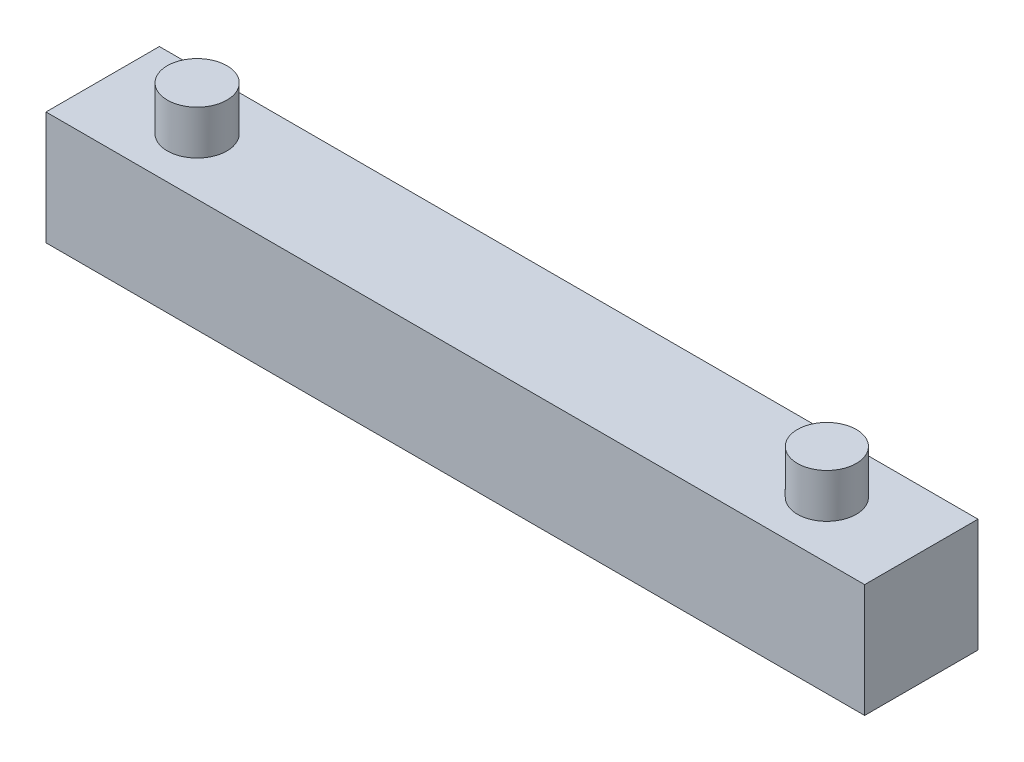
ISO-10303-21;
HEADER;
FILE_DESCRIPTION(('STEP AP214'),'2;1');
FILE_NAME('part.step','',(''),(''),'','','');
FILE_SCHEMA(('AUTOMOTIVE_DESIGN { 1 0 10303 214 1 1 1 1 }'));
ENDSEC;
DATA;
#1=APPLICATION_CONTEXT('core data for automotive mechanical design processes');
#2=APPLICATION_PROTOCOL_DEFINITION('international standard','automotive_design',2000,#1);
#3=PRODUCT_CONTEXT('',#1,'mechanical');
#4=PRODUCT('Part','Part','',(#3));
#5=PRODUCT_RELATED_PRODUCT_CATEGORY('part','',(#4));
#6=PRODUCT_DEFINITION_FORMATION('','',#4);
#7=PRODUCT_DEFINITION_CONTEXT('part definition',#1,'design');
#8=PRODUCT_DEFINITION('design','',#6,#7);
#9=PRODUCT_DEFINITION_SHAPE('','',#8);
#10=(LENGTH_UNIT() NAMED_UNIT(*) SI_UNIT(.MILLI.,.METRE.));
#11=(NAMED_UNIT(*) PLANE_ANGLE_UNIT() SI_UNIT($,.RADIAN.));
#12=(NAMED_UNIT(*) SI_UNIT($,.STERADIAN.) SOLID_ANGLE_UNIT());
#13=UNCERTAINTY_MEASURE_WITH_UNIT(LENGTH_MEASURE(1.E-05),#10,'distance_accuracy_value','');
#14=(GEOMETRIC_REPRESENTATION_CONTEXT(3) GLOBAL_UNCERTAINTY_ASSIGNED_CONTEXT((#13)) GLOBAL_UNIT_ASSIGNED_CONTEXT((#10,
#11,#12)) REPRESENTATION_CONTEXT('',''));
#15=CARTESIAN_POINT('',(0.,0.,0.));
#16=DIRECTION('',(0.,0.,1.));
#17=DIRECTION('',(1.,0.,0.));
#18=AXIS2_PLACEMENT_3D('',#15,#16,#17);
#19=CARTESIAN_POINT('',(0.,9.,0.));
#20=DIRECTION('',(0.,-1.,0.));
#21=DIRECTION('',(0.,0.,-1.));
#22=AXIS2_PLACEMENT_3D('',#19,#20,#21);
#23=PLANE('',#22);
#24=CARTESIAN_POINT('',(7.5,9.,-4.5));
#25=DIRECTION('',(0.,-1.,0.));
#26=DIRECTION('',(0.,0.,-1.));
#27=AXIS2_PLACEMENT_3D('',#24,#25,#26);
#28=CIRCLE('',#27,2.36648175817539);
#29=CARTESIAN_POINT('',(7.5,9.,-6.86648175817539));
#30=VERTEX_POINT('',#29);
#31=EDGE_CURVE('E41',#30,#30,#28,.F.);
#32=ORIENTED_EDGE('',*,*,#31,.F.);
#33=EDGE_LOOP('',(#32));
#34=FACE_BOUND('',#33,.T.);
#35=DIRECTION('',(0.,0.,1.));
#36=VECTOR('',#35,1.);
#37=CARTESIAN_POINT('',(0.,9.,0.));
#38=LINE('',#37,#36);
#39=CARTESIAN_POINT('',(0.,9.,-9.));
#40=VERTEX_POINT('',#39);
#41=CARTESIAN_POINT('',(0.,9.,0.));
#42=VERTEX_POINT('',#41);
#43=EDGE_CURVE('E85',#40,#42,#38,.T.);
#44=ORIENTED_EDGE('',*,*,#43,.T.);
#45=DIRECTION('',(1.,0.,0.));
#46=VECTOR('',#45,1.);
#47=CARTESIAN_POINT('',(0.,9.,0.));
#48=LINE('',#47,#46);
#49=CARTESIAN_POINT('',(65.,9.,0.));
#50=VERTEX_POINT('',#49);
#51=EDGE_CURVE('E80',#42,#50,#48,.T.);
#52=ORIENTED_EDGE('',*,*,#51,.T.);
#53=DIRECTION('',(0.,0.,-1.));
#54=VECTOR('',#53,1.);
#55=CARTESIAN_POINT('',(65.,9.,0.));
#56=LINE('',#55,#54);
#57=CARTESIAN_POINT('',(65.,9.,-9.));
#58=VERTEX_POINT('',#57);
#59=EDGE_CURVE('E83',#50,#58,#56,.T.);
#60=ORIENTED_EDGE('',*,*,#59,.T.);
#61=DIRECTION('',(-1.,0.,0.));
#62=VECTOR('',#61,1.);
#63=CARTESIAN_POINT('',(0.,9.,-9.));
#64=LINE('',#63,#62);
#65=EDGE_CURVE('E49',#58,#40,#64,.T.);
#66=ORIENTED_EDGE('',*,*,#65,.T.);
#67=EDGE_LOOP('',(#44,#52,#60,#66));
#68=FACE_BOUND('',#67,.T.);
#69=CARTESIAN_POINT('',(57.5,9.,-4.5));
#70=DIRECTION('',(0.,-1.,0.));
#71=DIRECTION('',(0.,0.,-1.));
#72=AXIS2_PLACEMENT_3D('',#69,#70,#71);
#73=CIRCLE('',#72,2.33730433443822);
#74=CARTESIAN_POINT('',(57.5,9.,-6.83730433443822));
#75=VERTEX_POINT('',#74);
#76=EDGE_CURVE('E11',#75,#75,#73,.F.);
#77=ORIENTED_EDGE('',*,*,#76,.F.);
#78=EDGE_LOOP('',(#77));
#79=FACE_BOUND('',#78,.T.);
#80=ADVANCED_FACE('F32',(#34,#68,#79),#23,.F.);
#81=CARTESIAN_POINT('',(0.,9.,0.));
#82=DIRECTION('',(1.,0.,0.));
#83=DIRECTION('',(0.,0.,-1.));
#84=AXIS2_PLACEMENT_3D('',#81,#82,#83);
#85=PLANE('',#84);
#86=DIRECTION('',(0.,0.,1.));
#87=VECTOR('',#86,1.);
#88=CARTESIAN_POINT('',(0.,0.,0.));
#89=LINE('',#88,#87);
#90=CARTESIAN_POINT('',(0.,0.,-9.));
#91=VERTEX_POINT('',#90);
#92=CARTESIAN_POINT('',(0.,0.,0.));
#93=VERTEX_POINT('',#92);
#94=EDGE_CURVE('E100',#91,#93,#89,.T.);
#95=ORIENTED_EDGE('',*,*,#94,.T.);
#96=DIRECTION('',(0.,-1.,0.));
#97=VECTOR('',#96,1.);
#98=CARTESIAN_POINT('',(0.,9.,0.));
#99=LINE('',#98,#97);
#100=EDGE_CURVE('E91',#42,#93,#99,.T.);
#101=ORIENTED_EDGE('',*,*,#100,.F.);
#102=ORIENTED_EDGE('',*,*,#43,.F.);
#103=DIRECTION('',(0.,-1.,0.));
#104=VECTOR('',#103,1.);
#105=CARTESIAN_POINT('',(0.,9.,-9.));
#106=LINE('',#105,#104);
#107=EDGE_CURVE('E96',#40,#91,#106,.T.);
#108=ORIENTED_EDGE('',*,*,#107,.T.);
#109=EDGE_LOOP('',(#95,#101,#102,#108));
#110=FACE_BOUND('',#109,.T.);
#111=ADVANCED_FACE('F34',(#110),#85,.F.);
#112=CARTESIAN_POINT('',(0.,9.,0.));
#113=DIRECTION('',(0.,0.,-1.));
#114=DIRECTION('',(-1.,0.,0.));
#115=AXIS2_PLACEMENT_3D('',#112,#113,#114);
#116=PLANE('',#115);
#117=DIRECTION('',(1.,0.,0.));
#118=VECTOR('',#117,1.);
#119=CARTESIAN_POINT('',(0.,0.,0.));
#120=LINE('',#119,#118);
#121=CARTESIAN_POINT('',(65.,0.,0.));
#122=VERTEX_POINT('',#121);
#123=EDGE_CURVE('E90',#93,#122,#120,.T.);
#124=ORIENTED_EDGE('',*,*,#123,.T.);
#125=DIRECTION('',(0.,-1.,0.));
#126=VECTOR('',#125,1.);
#127=CARTESIAN_POINT('',(65.,9.,0.));
#128=LINE('',#127,#126);
#129=EDGE_CURVE('E88',#50,#122,#128,.T.);
#130=ORIENTED_EDGE('',*,*,#129,.F.);
#131=ORIENTED_EDGE('',*,*,#51,.F.);
#132=ORIENTED_EDGE('',*,*,#100,.T.);
#133=EDGE_LOOP('',(#124,#130,#131,#132));
#134=FACE_BOUND('',#133,.T.);
#135=ADVANCED_FACE('F89',(#134),#116,.F.);
#136=CARTESIAN_POINT('',(65.,9.,0.));
#137=DIRECTION('',(-1.,0.,0.));
#138=DIRECTION('',(0.,0.,1.));
#139=AXIS2_PLACEMENT_3D('',#136,#137,#138);
#140=PLANE('',#139);
#141=DIRECTION('',(0.,0.,-1.));
#142=VECTOR('',#141,1.);
#143=CARTESIAN_POINT('',(65.,0.,0.));
#144=LINE('',#143,#142);
#145=CARTESIAN_POINT('',(65.,0.,-9.));
#146=VERTEX_POINT('',#145);
#147=EDGE_CURVE('E66',#122,#146,#144,.T.);
#148=ORIENTED_EDGE('',*,*,#147,.T.);
#149=DIRECTION('',(0.,-1.,0.));
#150=VECTOR('',#149,1.);
#151=CARTESIAN_POINT('',(65.,9.,-9.));
#152=LINE('',#151,#150);
#153=EDGE_CURVE('E92',#58,#146,#152,.T.);
#154=ORIENTED_EDGE('',*,*,#153,.F.);
#155=ORIENTED_EDGE('',*,*,#59,.F.);
#156=ORIENTED_EDGE('',*,*,#129,.T.);
#157=EDGE_LOOP('',(#148,#154,#155,#156));
#158=FACE_BOUND('',#157,.T.);
#159=ADVANCED_FACE('F94',(#158),#140,.F.);
#160=CARTESIAN_POINT('',(0.,9.,-9.));
#161=DIRECTION('',(0.,0.,1.));
#162=DIRECTION('',(1.,0.,0.));
#163=AXIS2_PLACEMENT_3D('',#160,#161,#162);
#164=PLANE('',#163);
#165=DIRECTION('',(-1.,0.,0.));
#166=VECTOR('',#165,1.);
#167=CARTESIAN_POINT('',(0.,0.,-9.));
#168=LINE('',#167,#166);
#169=EDGE_CURVE('E72',#146,#91,#168,.T.);
#170=ORIENTED_EDGE('',*,*,#169,.T.);
#171=ORIENTED_EDGE('',*,*,#107,.F.);
#172=ORIENTED_EDGE('',*,*,#65,.F.);
#173=ORIENTED_EDGE('',*,*,#153,.T.);
#174=EDGE_LOOP('',(#170,#171,#172,#173));
#175=FACE_BOUND('',#174,.T.);
#176=ADVANCED_FACE('F126',(#175),#164,.F.);
#177=CARTESIAN_POINT('',(0.,0.,0.));
#178=DIRECTION('',(0.,-1.,0.));
#179=DIRECTION('',(0.,0.,-1.));
#180=AXIS2_PLACEMENT_3D('',#177,#178,#179);
#181=PLANE('',#180);
#182=ORIENTED_EDGE('',*,*,#94,.F.);
#183=ORIENTED_EDGE('',*,*,#169,.F.);
#184=ORIENTED_EDGE('',*,*,#147,.F.);
#185=ORIENTED_EDGE('',*,*,#123,.F.);
#186=EDGE_LOOP('',(#182,#183,#184,#185));
#187=FACE_BOUND('',#186,.T.);
#188=ADVANCED_FACE('F123',(#187),#181,.T.);
#189=CARTESIAN_POINT('',(7.5,12.5,-4.5));
#190=DIRECTION('',(0.,-1.,0.));
#191=DIRECTION('',(0.,0.,-1.));
#192=AXIS2_PLACEMENT_3D('',#189,#190,#191);
#193=CYLINDRICAL_SURFACE('',#192,2.36648175817539);
#194=CARTESIAN_POINT('',(7.5,12.5,-4.5));
#195=DIRECTION('',(0.,1.,0.));
#196=DIRECTION('',(0.,0.,1.));
#197=AXIS2_PLACEMENT_3D('',#194,#195,#196);
#198=CIRCLE('',#197,2.36648175817539);
#199=CARTESIAN_POINT('',(7.5,12.5,-2.13351824182461));
#200=VERTEX_POINT('',#199);
#201=EDGE_CURVE('E103',#200,#200,#198,.T.);
#202=ORIENTED_EDGE('',*,*,#201,.F.);
#203=EDGE_LOOP('',(#202));
#204=FACE_BOUND('',#203,.T.);
#205=ORIENTED_EDGE('',*,*,#31,.T.);
#206=EDGE_LOOP('',(#205));
#207=FACE_BOUND('',#206,.T.);
#208=ADVANCED_FACE('F112',(#204,#207),#193,.T.);
#209=CARTESIAN_POINT('',(7.5,12.5,-4.5));
#210=DIRECTION('',(0.,1.,0.));
#211=DIRECTION('',(0.,0.,1.));
#212=AXIS2_PLACEMENT_3D('',#209,#210,#211);
#213=PLANE('',#212);
#214=ORIENTED_EDGE('',*,*,#201,.T.);
#215=EDGE_LOOP('',(#214));
#216=FACE_BOUND('',#215,.T.);
#217=ADVANCED_FACE('F154',(#216),#213,.T.);
#218=CARTESIAN_POINT('',(57.5,12.5,-4.5));
#219=DIRECTION('',(0.,-1.,0.));
#220=DIRECTION('',(0.,0.,-1.));
#221=AXIS2_PLACEMENT_3D('',#218,#219,#220);
#222=CYLINDRICAL_SURFACE('',#221,2.33730433443822);
#223=CARTESIAN_POINT('',(57.5,12.5,-4.5));
#224=DIRECTION('',(0.,1.,0.));
#225=DIRECTION('',(0.,0.,1.));
#226=AXIS2_PLACEMENT_3D('',#223,#224,#225);
#227=CIRCLE('',#226,2.33730433443822);
#228=CARTESIAN_POINT('',(57.5,12.5,-2.16269566556178));
#229=VERTEX_POINT('',#228);
#230=EDGE_CURVE('E205',#229,#229,#227,.T.);
#231=ORIENTED_EDGE('',*,*,#230,.F.);
#232=EDGE_LOOP('',(#231));
#233=FACE_BOUND('',#232,.T.);
#234=ORIENTED_EDGE('',*,*,#76,.T.);
#235=EDGE_LOOP('',(#234));
#236=FACE_BOUND('',#235,.T.);
#237=ADVANCED_FACE('F161',(#233,#236),#222,.T.);
#238=CARTESIAN_POINT('',(57.5,12.5,-4.5));
#239=DIRECTION('',(0.,1.,0.));
#240=DIRECTION('',(0.,0.,1.));
#241=AXIS2_PLACEMENT_3D('',#238,#239,#240);
#242=PLANE('',#241);
#243=ORIENTED_EDGE('',*,*,#230,.T.);
#244=EDGE_LOOP('',(#243));
#245=FACE_BOUND('',#244,.T.);
#246=ADVANCED_FACE('F168',(#245),#242,.T.);
#247=CLOSED_SHELL('',(#80,#111,#135,#159,#176,#188,#208,#217,#237,#246));
#248=MANIFOLD_SOLID_BREP('B2',#247);
#249=ADVANCED_BREP_SHAPE_REPRESENTATION('',(#18,#248),#14);
#250=SHAPE_DEFINITION_REPRESENTATION(#9,#249);
ENDSEC;
END-ISO-10303-21;
